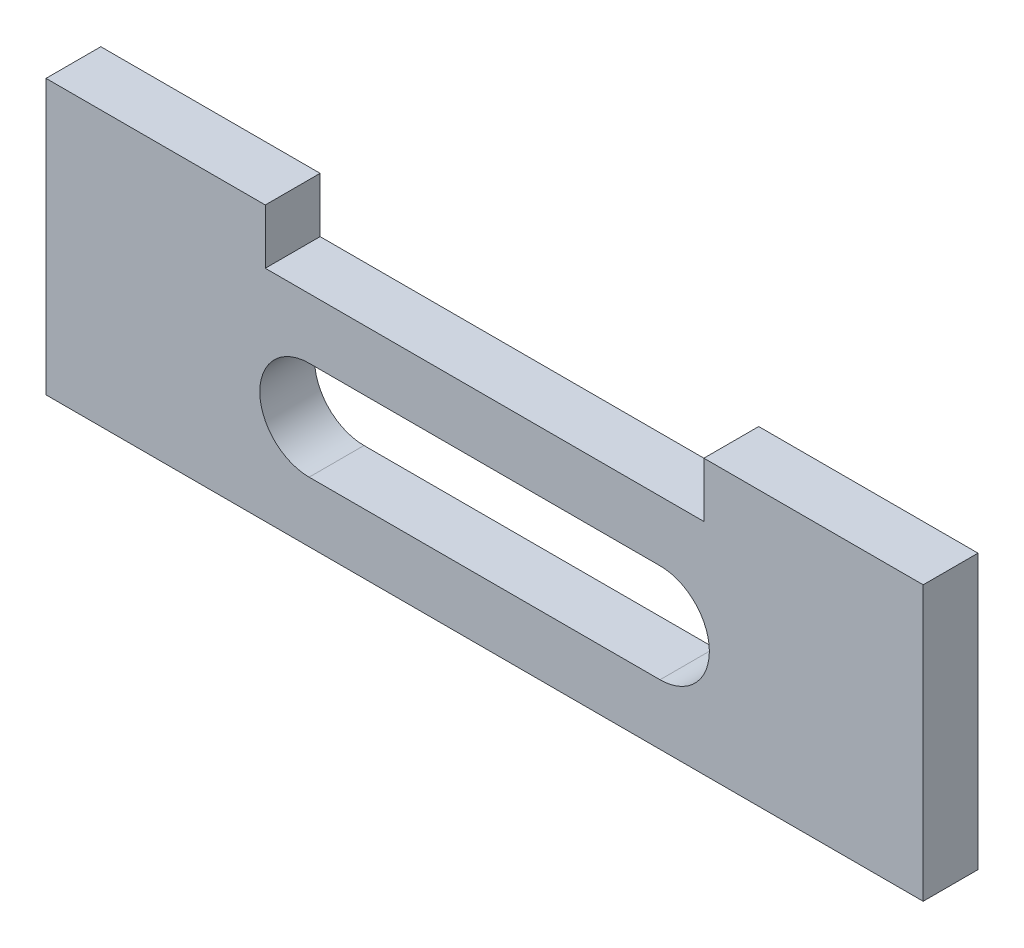
ISO-10303-21;
HEADER;
FILE_DESCRIPTION(('STEP AP214'),'2;1');
FILE_NAME('part.step','',(''),(''),'','','');
FILE_SCHEMA(('AUTOMOTIVE_DESIGN { 1 0 10303 214 1 1 1 1 }'));
ENDSEC;
DATA;
#1=APPLICATION_CONTEXT('core data for automotive mechanical design processes');
#2=APPLICATION_PROTOCOL_DEFINITION('international standard','automotive_design',2000,#1);
#3=PRODUCT_CONTEXT('',#1,'mechanical');
#4=PRODUCT('Part','Part','',(#3));
#5=PRODUCT_RELATED_PRODUCT_CATEGORY('part','',(#4));
#6=PRODUCT_DEFINITION_FORMATION('','',#4);
#7=PRODUCT_DEFINITION_CONTEXT('part definition',#1,'design');
#8=PRODUCT_DEFINITION('design','',#6,#7);
#9=PRODUCT_DEFINITION_SHAPE('','',#8);
#10=(LENGTH_UNIT() NAMED_UNIT(*) SI_UNIT(.MILLI.,.METRE.));
#11=(NAMED_UNIT(*) PLANE_ANGLE_UNIT() SI_UNIT($,.RADIAN.));
#12=(NAMED_UNIT(*) SI_UNIT($,.STERADIAN.) SOLID_ANGLE_UNIT());
#13=UNCERTAINTY_MEASURE_WITH_UNIT(LENGTH_MEASURE(1.E-05),#10,'distance_accuracy_value','');
#14=(GEOMETRIC_REPRESENTATION_CONTEXT(3) GLOBAL_UNCERTAINTY_ASSIGNED_CONTEXT((#13)) GLOBAL_UNIT_ASSIGNED_CONTEXT((#10,
#11,#12)) REPRESENTATION_CONTEXT('',''));
#15=CARTESIAN_POINT('',(0.,0.,0.));
#16=DIRECTION('',(0.,0.,1.));
#17=DIRECTION('',(1.,0.,0.));
#18=AXIS2_PLACEMENT_3D('',#15,#16,#17);
#19=CARTESIAN_POINT('',(0.,12.7,3.175));
#20=DIRECTION('',(0.,-1.,0.));
#21=DIRECTION('',(0.,0.,-1.));
#22=AXIS2_PLACEMENT_3D('',#19,#20,#21);
#23=PLANE('',#22);
#24=DIRECTION('',(0.,0.,1.));
#25=VECTOR('',#24,1.);
#26=CARTESIAN_POINT('',(38.1,12.7,0.));
#27=LINE('',#26,#25);
#28=CARTESIAN_POINT('',(38.1,12.7,0.));
#29=VERTEX_POINT('',#28);
#30=CARTESIAN_POINT('',(38.1,12.7,3.175));
#31=VERTEX_POINT('',#30);
#32=EDGE_CURVE('E141',#29,#31,#27,.T.);
#33=ORIENTED_EDGE('',*,*,#32,.F.);
#34=DIRECTION('',(-1.,0.,0.));
#35=VECTOR('',#34,1.);
#36=CARTESIAN_POINT('',(0.,12.7,0.));
#37=LINE('',#36,#35);
#38=CARTESIAN_POINT('',(12.7,12.7,0.));
#39=VERTEX_POINT('',#38);
#40=EDGE_CURVE('E178',#29,#39,#37,.T.);
#41=ORIENTED_EDGE('',*,*,#40,.T.);
#42=DIRECTION('',(0.,0.,-1.));
#43=VECTOR('',#42,1.);
#44=CARTESIAN_POINT('',(12.7,12.7,0.));
#45=LINE('',#44,#43);
#46=CARTESIAN_POINT('',(12.7,12.7,3.175));
#47=VERTEX_POINT('',#46);
#48=EDGE_CURVE('E144',#47,#39,#45,.T.);
#49=ORIENTED_EDGE('',*,*,#48,.F.);
#50=DIRECTION('',(-1.,0.,0.));
#51=VECTOR('',#50,1.);
#52=CARTESIAN_POINT('',(0.,12.7,3.175));
#53=LINE('',#52,#51);
#54=EDGE_CURVE('E35',#31,#47,#53,.T.);
#55=ORIENTED_EDGE('',*,*,#54,.F.);
#56=EDGE_LOOP('',(#33,#41,#49,#55));
#57=FACE_BOUND('',#56,.T.);
#58=ADVANCED_FACE('F31',(#57),#23,.F.);
#59=CARTESIAN_POINT('',(0.,0.,3.175));
#60=DIRECTION('',(1.,0.,0.));
#61=DIRECTION('',(0.,0.,-1.));
#62=AXIS2_PLACEMENT_3D('',#59,#60,#61);
#63=PLANE('',#62);
#64=DIRECTION('',(0.,-1.,0.));
#65=VECTOR('',#64,1.);
#66=CARTESIAN_POINT('',(0.,0.,0.));
#67=LINE('',#66,#65);
#68=CARTESIAN_POINT('',(0.,15.875,0.));
#69=VERTEX_POINT('',#68);
#70=CARTESIAN_POINT('',(0.,0.,0.));
#71=VERTEX_POINT('',#70);
#72=EDGE_CURVE('E195',#69,#71,#67,.T.);
#73=ORIENTED_EDGE('',*,*,#72,.T.);
#74=DIRECTION('',(0.,0.,-1.));
#75=VECTOR('',#74,1.);
#76=CARTESIAN_POINT('',(0.,0.,3.175));
#77=LINE('',#76,#75);
#78=CARTESIAN_POINT('',(0.,0.,3.175));
#79=VERTEX_POINT('',#78);
#80=EDGE_CURVE('E11',#79,#71,#77,.T.);
#81=ORIENTED_EDGE('',*,*,#80,.F.);
#82=DIRECTION('',(0.,-1.,0.));
#83=VECTOR('',#82,1.);
#84=CARTESIAN_POINT('',(0.,0.,3.175));
#85=LINE('',#84,#83);
#86=CARTESIAN_POINT('',(0.,15.875,3.175));
#87=VERTEX_POINT('',#86);
#88=EDGE_CURVE('E180',#87,#79,#85,.T.);
#89=ORIENTED_EDGE('',*,*,#88,.F.);
#90=DIRECTION('',(0.,0.,1.));
#91=VECTOR('',#90,1.);
#92=CARTESIAN_POINT('',(0.,15.875,0.));
#93=LINE('',#92,#91);
#94=EDGE_CURVE('E148',#69,#87,#93,.T.);
#95=ORIENTED_EDGE('',*,*,#94,.F.);
#96=EDGE_LOOP('',(#73,#81,#89,#95));
#97=FACE_BOUND('',#96,.T.);
#98=ADVANCED_FACE('F33',(#97),#63,.F.);
#99=CARTESIAN_POINT('',(0.,0.,3.175));
#100=DIRECTION('',(0.,1.,0.));
#101=DIRECTION('',(0.,0.,1.));
#102=AXIS2_PLACEMENT_3D('',#99,#100,#101);
#103=PLANE('',#102);
#104=DIRECTION('',(1.,0.,0.));
#105=VECTOR('',#104,1.);
#106=CARTESIAN_POINT('',(0.,0.,0.));
#107=LINE('',#106,#105);
#108=CARTESIAN_POINT('',(50.8,0.,0.));
#109=VERTEX_POINT('',#108);
#110=EDGE_CURVE('E197',#71,#109,#107,.T.);
#111=ORIENTED_EDGE('',*,*,#110,.T.);
#112=DIRECTION('',(0.,0.,-1.));
#113=VECTOR('',#112,1.);
#114=CARTESIAN_POINT('',(50.8,0.,3.175));
#115=LINE('',#114,#113);
#116=CARTESIAN_POINT('',(50.8,0.,3.175));
#117=VERTEX_POINT('',#116);
#118=EDGE_CURVE('E41',#117,#109,#115,.T.);
#119=ORIENTED_EDGE('',*,*,#118,.F.);
#120=DIRECTION('',(1.,0.,0.));
#121=VECTOR('',#120,1.);
#122=CARTESIAN_POINT('',(0.,0.,3.175));
#123=LINE('',#122,#121);
#124=EDGE_CURVE('E189',#79,#117,#123,.T.);
#125=ORIENTED_EDGE('',*,*,#124,.F.);
#126=ORIENTED_EDGE('',*,*,#80,.T.);
#127=EDGE_LOOP('',(#111,#119,#125,#126));
#128=FACE_BOUND('',#127,.T.);
#129=ADVANCED_FACE('F212',(#128),#103,.F.);
#130=CARTESIAN_POINT('',(50.8,0.,3.175));
#131=DIRECTION('',(-1.,0.,0.));
#132=DIRECTION('',(0.,0.,1.));
#133=AXIS2_PLACEMENT_3D('',#130,#131,#132);
#134=PLANE('',#133);
#135=DIRECTION('',(0.,1.,0.));
#136=VECTOR('',#135,1.);
#137=CARTESIAN_POINT('',(50.8,0.,0.));
#138=LINE('',#137,#136);
#139=CARTESIAN_POINT('',(50.8,15.875,0.));
#140=VERTEX_POINT('',#139);
#141=EDGE_CURVE('E181',#109,#140,#138,.T.);
#142=ORIENTED_EDGE('',*,*,#141,.T.);
#143=DIRECTION('',(0.,0.,-1.));
#144=VECTOR('',#143,1.);
#145=CARTESIAN_POINT('',(50.8,15.875,0.));
#146=LINE('',#145,#144);
#147=CARTESIAN_POINT('',(50.8,15.875,3.175));
#148=VERTEX_POINT('',#147);
#149=EDGE_CURVE('E131',#148,#140,#146,.T.);
#150=ORIENTED_EDGE('',*,*,#149,.F.);
#151=DIRECTION('',(0.,1.,0.));
#152=VECTOR('',#151,1.);
#153=CARTESIAN_POINT('',(50.8,0.,3.175));
#154=LINE('',#153,#152);
#155=EDGE_CURVE('E127',#117,#148,#154,.T.);
#156=ORIENTED_EDGE('',*,*,#155,.F.);
#157=ORIENTED_EDGE('',*,*,#118,.T.);
#158=EDGE_LOOP('',(#142,#150,#156,#157));
#159=FACE_BOUND('',#158,.T.);
#160=ADVANCED_FACE('F200',(#159),#134,.F.);
#161=CARTESIAN_POINT('',(0.,12.7,3.175));
#162=DIRECTION('',(0.,0.,-1.));
#163=DIRECTION('',(-1.,0.,0.));
#164=AXIS2_PLACEMENT_3D('',#161,#162,#163);
#165=PLANE('',#164);
#166=DIRECTION('',(1.,0.,0.));
#167=VECTOR('',#166,1.);
#168=CARTESIAN_POINT('',(15.24,3.49249999999999,3.175));
#169=LINE('',#168,#167);
#170=CARTESIAN_POINT('',(15.24,3.49249999999999,3.175));
#171=VERTEX_POINT('',#170);
#172=CARTESIAN_POINT('',(35.56,3.4925,3.175));
#173=VERTEX_POINT('',#172);
#174=EDGE_CURVE('E371',#171,#173,#169,.T.);
#175=ORIENTED_EDGE('',*,*,#174,.F.);
#176=CARTESIAN_POINT('',(15.24,6.35,3.175));
#177=DIRECTION('',(0.,0.,1.));
#178=DIRECTION('',(1.,0.,0.));
#179=AXIS2_PLACEMENT_3D('',#176,#177,#178);
#180=CIRCLE('',#179,2.8575);
#181=CARTESIAN_POINT('',(15.24,9.20749999999999,3.175));
#182=VERTEX_POINT('',#181);
#183=EDGE_CURVE('E176',#182,#171,#180,.T.);
#184=ORIENTED_EDGE('',*,*,#183,.F.);
#185=DIRECTION('',(-1.,0.,0.));
#186=VECTOR('',#185,1.);
#187=CARTESIAN_POINT('',(15.24,9.20749999999999,3.175));
#188=LINE('',#187,#186);
#189=CARTESIAN_POINT('',(35.56,9.20749999999999,3.175));
#190=VERTEX_POINT('',#189);
#191=EDGE_CURVE('E365',#190,#182,#188,.T.);
#192=ORIENTED_EDGE('',*,*,#191,.F.);
#193=CARTESIAN_POINT('',(35.56,6.35,3.175));
#194=DIRECTION('',(0.,0.,1.));
#195=DIRECTION('',(1.,0.,0.));
#196=AXIS2_PLACEMENT_3D('',#193,#194,#195);
#197=CIRCLE('',#196,2.8575);
#198=EDGE_CURVE('E368',#173,#190,#197,.T.);
#199=ORIENTED_EDGE('',*,*,#198,.F.);
#200=EDGE_LOOP('',(#175,#184,#192,#199));
#201=FACE_BOUND('',#200,.T.);
#202=ORIENTED_EDGE('',*,*,#88,.T.);
#203=ORIENTED_EDGE('',*,*,#124,.T.);
#204=ORIENTED_EDGE('',*,*,#155,.T.);
#205=DIRECTION('',(1.,0.,0.));
#206=VECTOR('',#205,1.);
#207=CARTESIAN_POINT('',(38.1,15.875,3.175));
#208=LINE('',#207,#206);
#209=CARTESIAN_POINT('',(38.1,15.875,3.175));
#210=VERTEX_POINT('',#209);
#211=EDGE_CURVE('E119',#210,#148,#208,.T.);
#212=ORIENTED_EDGE('',*,*,#211,.F.);
#213=DIRECTION('',(0.,-1.,0.));
#214=VECTOR('',#213,1.);
#215=CARTESIAN_POINT('',(38.1,15.875,3.175));
#216=LINE('',#215,#214);
#217=EDGE_CURVE('E124',#210,#31,#216,.T.);
#218=ORIENTED_EDGE('',*,*,#217,.T.);
#219=ORIENTED_EDGE('',*,*,#54,.T.);
#220=DIRECTION('',(0.,-1.,0.));
#221=VECTOR('',#220,1.);
#222=CARTESIAN_POINT('',(12.7,15.875,3.175));
#223=LINE('',#222,#221);
#224=CARTESIAN_POINT('',(12.7,15.875,3.175));
#225=VERTEX_POINT('',#224);
#226=EDGE_CURVE('E171',#225,#47,#223,.T.);
#227=ORIENTED_EDGE('',*,*,#226,.F.);
#228=DIRECTION('',(1.,0.,0.));
#229=VECTOR('',#228,1.);
#230=CARTESIAN_POINT('',(0.,15.875,3.175));
#231=LINE('',#230,#229);
#232=EDGE_CURVE('E155',#87,#225,#231,.T.);
#233=ORIENTED_EDGE('',*,*,#232,.F.);
#234=EDGE_LOOP('',(#202,#203,#204,#212,#218,#219,#227,#233));
#235=FACE_BOUND('',#234,.T.);
#236=ADVANCED_FACE('F122',(#201,#235),#165,.F.);
#237=CARTESIAN_POINT('',(0.,12.7,0.));
#238=DIRECTION('',(0.,0.,-1.));
#239=DIRECTION('',(-1.,0.,0.));
#240=AXIS2_PLACEMENT_3D('',#237,#238,#239);
#241=PLANE('',#240);
#242=CARTESIAN_POINT('',(15.24,6.35,0.));
#243=DIRECTION('',(0.,0.,1.));
#244=DIRECTION('',(1.,0.,0.));
#245=AXIS2_PLACEMENT_3D('',#242,#243,#244);
#246=CIRCLE('',#245,2.8575);
#247=CARTESIAN_POINT('',(15.24,9.20749999999999,0.));
#248=VERTEX_POINT('',#247);
#249=CARTESIAN_POINT('',(15.24,3.49249999999999,0.));
#250=VERTEX_POINT('',#249);
#251=EDGE_CURVE('E165',#248,#250,#246,.T.);
#252=ORIENTED_EDGE('',*,*,#251,.T.);
#253=DIRECTION('',(1.,0.,0.));
#254=VECTOR('',#253,1.);
#255=CARTESIAN_POINT('',(15.24,3.49249999999999,0.));
#256=LINE('',#255,#254);
#257=CARTESIAN_POINT('',(35.56,3.49249999999999,0.));
#258=VERTEX_POINT('',#257);
#259=EDGE_CURVE('E379',#250,#258,#256,.T.);
#260=ORIENTED_EDGE('',*,*,#259,.T.);
#261=CARTESIAN_POINT('',(35.56,6.35,0.));
#262=DIRECTION('',(0.,0.,1.));
#263=DIRECTION('',(1.,0.,0.));
#264=AXIS2_PLACEMENT_3D('',#261,#262,#263);
#265=CIRCLE('',#264,2.8575);
#266=CARTESIAN_POINT('',(35.56,9.20749999999999,0.));
#267=VERTEX_POINT('',#266);
#268=EDGE_CURVE('E377',#258,#267,#265,.T.);
#269=ORIENTED_EDGE('',*,*,#268,.T.);
#270=DIRECTION('',(-1.,0.,0.));
#271=VECTOR('',#270,1.);
#272=CARTESIAN_POINT('',(15.24,9.20749999999999,0.));
#273=LINE('',#272,#271);
#274=EDGE_CURVE('E360',#267,#248,#273,.T.);
#275=ORIENTED_EDGE('',*,*,#274,.T.);
#276=EDGE_LOOP('',(#252,#260,#269,#275));
#277=FACE_BOUND('',#276,.T.);
#278=ORIENTED_EDGE('',*,*,#72,.F.);
#279=DIRECTION('',(-1.,0.,0.));
#280=VECTOR('',#279,1.);
#281=CARTESIAN_POINT('',(0.,15.875,0.));
#282=LINE('',#281,#280);
#283=CARTESIAN_POINT('',(12.7,15.875,0.));
#284=VERTEX_POINT('',#283);
#285=EDGE_CURVE('E159',#284,#69,#282,.T.);
#286=ORIENTED_EDGE('',*,*,#285,.F.);
#287=DIRECTION('',(0.,-1.,0.));
#288=VECTOR('',#287,1.);
#289=CARTESIAN_POINT('',(12.7,15.875,0.));
#290=LINE('',#289,#288);
#291=EDGE_CURVE('E162',#284,#39,#290,.T.);
#292=ORIENTED_EDGE('',*,*,#291,.T.);
#293=ORIENTED_EDGE('',*,*,#40,.F.);
#294=DIRECTION('',(0.,-1.,0.));
#295=VECTOR('',#294,1.);
#296=CARTESIAN_POINT('',(38.1,15.875,0.));
#297=LINE('',#296,#295);
#298=CARTESIAN_POINT('',(38.1,15.875,0.));
#299=VERTEX_POINT('',#298);
#300=EDGE_CURVE('E145',#299,#29,#297,.T.);
#301=ORIENTED_EDGE('',*,*,#300,.F.);
#302=DIRECTION('',(-1.,0.,0.));
#303=VECTOR('',#302,1.);
#304=CARTESIAN_POINT('',(38.1,15.875,0.));
#305=LINE('',#304,#303);
#306=EDGE_CURVE('E137',#140,#299,#305,.T.);
#307=ORIENTED_EDGE('',*,*,#306,.F.);
#308=ORIENTED_EDGE('',*,*,#141,.F.);
#309=ORIENTED_EDGE('',*,*,#110,.F.);
#310=EDGE_LOOP('',(#278,#286,#292,#293,#301,#307,#308,#309));
#311=FACE_BOUND('',#310,.T.);
#312=ADVANCED_FACE('F203',(#277,#311),#241,.T.);
#313=CARTESIAN_POINT('',(15.24,6.35,0.));
#314=DIRECTION('',(0.,0.,1.));
#315=DIRECTION('',(1.,0.,0.));
#316=AXIS2_PLACEMENT_3D('',#313,#314,#315);
#317=CYLINDRICAL_SURFACE('',#316,2.8575);
#318=ORIENTED_EDGE('',*,*,#183,.T.);
#319=DIRECTION('',(0.,0.,1.));
#320=VECTOR('',#319,1.);
#321=CARTESIAN_POINT('',(15.24,3.49249999999999,0.));
#322=LINE('',#321,#320);
#323=EDGE_CURVE('E356',#250,#171,#322,.T.);
#324=ORIENTED_EDGE('',*,*,#323,.F.);
#325=ORIENTED_EDGE('',*,*,#251,.F.);
#326=DIRECTION('',(0.,0.,1.));
#327=VECTOR('',#326,1.);
#328=CARTESIAN_POINT('',(15.24,9.20749999999999,0.));
#329=LINE('',#328,#327);
#330=EDGE_CURVE('E198',#248,#182,#329,.T.);
#331=ORIENTED_EDGE('',*,*,#330,.T.);
#332=EDGE_LOOP('',(#318,#324,#325,#331));
#333=FACE_BOUND('',#332,.T.);
#334=ADVANCED_FACE('F240',(#333),#317,.F.);
#335=CARTESIAN_POINT('',(15.24,9.20749999999999,0.));
#336=DIRECTION('',(0.,1.,0.));
#337=DIRECTION('',(-1.,0.,0.));
#338=AXIS2_PLACEMENT_3D('',#335,#336,#337);
#339=PLANE('',#338);
#340=ORIENTED_EDGE('',*,*,#191,.T.);
#341=ORIENTED_EDGE('',*,*,#330,.F.);
#342=ORIENTED_EDGE('',*,*,#274,.F.);
#343=DIRECTION('',(0.,0.,1.));
#344=VECTOR('',#343,1.);
#345=CARTESIAN_POINT('',(35.56,9.20749999999999,0.));
#346=LINE('',#345,#344);
#347=EDGE_CURVE('E362',#267,#190,#346,.T.);
#348=ORIENTED_EDGE('',*,*,#347,.T.);
#349=EDGE_LOOP('',(#340,#341,#342,#348));
#350=FACE_BOUND('',#349,.T.);
#351=ADVANCED_FACE('F247',(#350),#339,.F.);
#352=CARTESIAN_POINT('',(35.56,6.35,0.));
#353=DIRECTION('',(0.,0.,1.));
#354=DIRECTION('',(1.,0.,0.));
#355=AXIS2_PLACEMENT_3D('',#352,#353,#354);
#356=CYLINDRICAL_SURFACE('',#355,2.8575);
#357=ORIENTED_EDGE('',*,*,#198,.T.);
#358=ORIENTED_EDGE('',*,*,#347,.F.);
#359=ORIENTED_EDGE('',*,*,#268,.F.);
#360=DIRECTION('',(0.,0.,1.));
#361=VECTOR('',#360,1.);
#362=CARTESIAN_POINT('',(35.56,3.4925,0.));
#363=LINE('',#362,#361);
#364=EDGE_CURVE('E359',#258,#173,#363,.T.);
#365=ORIENTED_EDGE('',*,*,#364,.T.);
#366=EDGE_LOOP('',(#357,#358,#359,#365));
#367=FACE_BOUND('',#366,.T.);
#368=ADVANCED_FACE('F255',(#367),#356,.F.);
#369=CARTESIAN_POINT('',(15.24,3.49249999999999,0.));
#370=DIRECTION('',(0.,-1.,0.));
#371=DIRECTION('',(0.,0.,-1.));
#372=AXIS2_PLACEMENT_3D('',#369,#370,#371);
#373=PLANE('',#372);
#374=ORIENTED_EDGE('',*,*,#174,.T.);
#375=ORIENTED_EDGE('',*,*,#364,.F.);
#376=ORIENTED_EDGE('',*,*,#259,.F.);
#377=ORIENTED_EDGE('',*,*,#323,.T.);
#378=EDGE_LOOP('',(#374,#375,#376,#377));
#379=FACE_BOUND('',#378,.T.);
#380=ADVANCED_FACE('F263',(#379),#373,.F.);
#381=CARTESIAN_POINT('',(12.7,15.875,0.));
#382=DIRECTION('',(-1.,0.,0.));
#383=DIRECTION('',(0.,0.,1.));
#384=AXIS2_PLACEMENT_3D('',#381,#382,#383);
#385=PLANE('',#384);
#386=ORIENTED_EDGE('',*,*,#48,.T.);
#387=ORIENTED_EDGE('',*,*,#291,.F.);
#388=DIRECTION('',(0.,0.,-1.));
#389=VECTOR('',#388,1.);
#390=CARTESIAN_POINT('',(12.7,15.875,0.));
#391=LINE('',#390,#389);
#392=EDGE_CURVE('E157',#225,#284,#391,.T.);
#393=ORIENTED_EDGE('',*,*,#392,.F.);
#394=ORIENTED_EDGE('',*,*,#226,.T.);
#395=EDGE_LOOP('',(#386,#387,#393,#394));
#396=FACE_BOUND('',#395,.T.);
#397=ADVANCED_FACE('F271',(#396),#385,.F.);
#398=CARTESIAN_POINT('',(0.,15.875,3.175));
#399=DIRECTION('',(0.,1.,0.));
#400=DIRECTION('',(0.,0.,1.));
#401=AXIS2_PLACEMENT_3D('',#398,#399,#400);
#402=PLANE('',#401);
#403=ORIENTED_EDGE('',*,*,#94,.T.);
#404=ORIENTED_EDGE('',*,*,#232,.T.);
#405=ORIENTED_EDGE('',*,*,#392,.T.);
#406=ORIENTED_EDGE('',*,*,#285,.T.);
#407=EDGE_LOOP('',(#403,#404,#405,#406));
#408=FACE_BOUND('',#407,.T.);
#409=ADVANCED_FACE('F279',(#408),#402,.T.);
#410=CARTESIAN_POINT('',(38.1,15.875,0.));
#411=DIRECTION('',(1.,0.,0.));
#412=DIRECTION('',(0.,0.,-1.));
#413=AXIS2_PLACEMENT_3D('',#410,#411,#412);
#414=PLANE('',#413);
#415=ORIENTED_EDGE('',*,*,#32,.T.);
#416=ORIENTED_EDGE('',*,*,#217,.F.);
#417=DIRECTION('',(0.,0.,1.));
#418=VECTOR('',#417,1.);
#419=CARTESIAN_POINT('',(38.1,15.875,0.));
#420=LINE('',#419,#418);
#421=EDGE_CURVE('E132',#299,#210,#420,.T.);
#422=ORIENTED_EDGE('',*,*,#421,.F.);
#423=ORIENTED_EDGE('',*,*,#300,.T.);
#424=EDGE_LOOP('',(#415,#416,#422,#423));
#425=FACE_BOUND('',#424,.T.);
#426=ADVANCED_FACE('F143',(#425),#414,.F.);
#427=CARTESIAN_POINT('',(38.1,15.875,3.175));
#428=DIRECTION('',(0.,1.,0.));
#429=DIRECTION('',(0.,0.,1.));
#430=AXIS2_PLACEMENT_3D('',#427,#428,#429);
#431=PLANE('',#430);
#432=ORIENTED_EDGE('',*,*,#421,.T.);
#433=ORIENTED_EDGE('',*,*,#211,.T.);
#434=ORIENTED_EDGE('',*,*,#149,.T.);
#435=ORIENTED_EDGE('',*,*,#306,.T.);
#436=EDGE_LOOP('',(#432,#433,#434,#435));
#437=FACE_BOUND('',#436,.T.);
#438=ADVANCED_FACE('F135',(#437),#431,.T.);
#439=CLOSED_SHELL('',(#58,#98,#129,#160,#236,#312,#334,#351,#368,#380,#397,#409,#426,#438));
#440=MANIFOLD_SOLID_BREP('B2',#439);
#441=ADVANCED_BREP_SHAPE_REPRESENTATION('',(#18,#440),#14);
#442=SHAPE_DEFINITION_REPRESENTATION(#9,#441);
ENDSEC;
END-ISO-10303-21;
